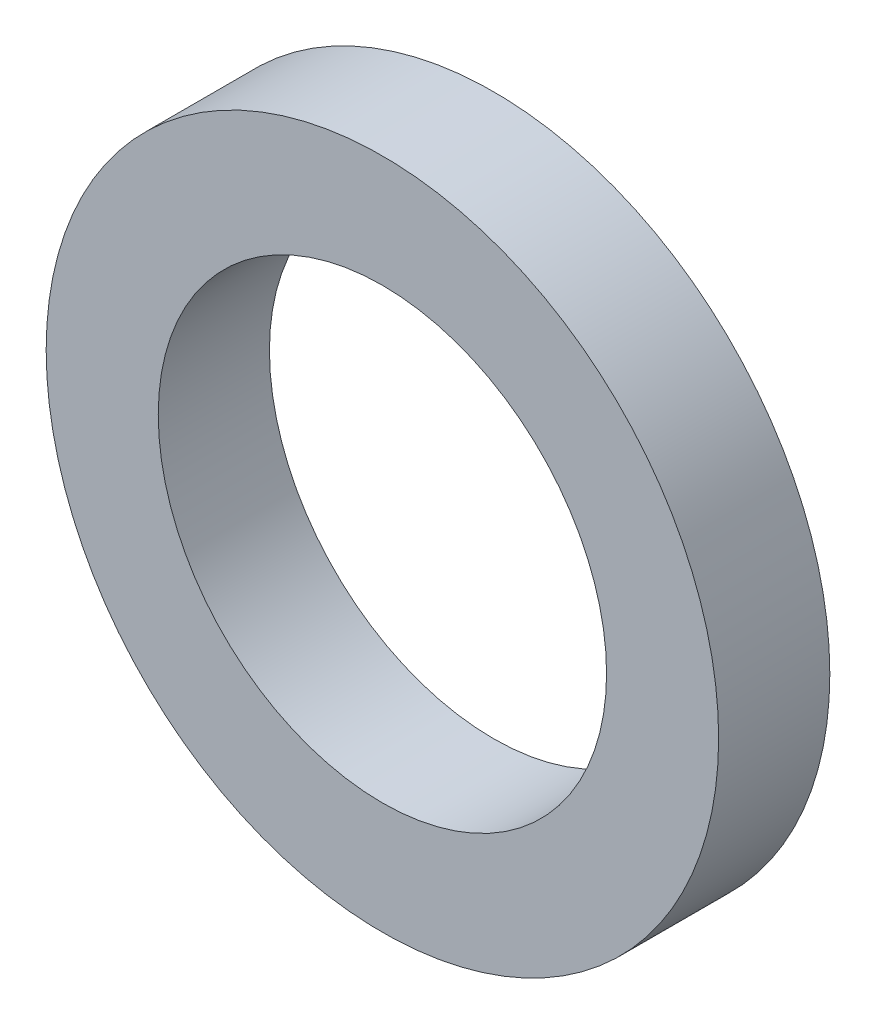
ISO-10303-21;
HEADER;
FILE_DESCRIPTION(('STEP AP214'),'2;1');
FILE_NAME('part.step','',(''),(''),'','','');
FILE_SCHEMA(('AUTOMOTIVE_DESIGN { 1 0 10303 214 1 1 1 1 }'));
ENDSEC;
DATA;
#1=APPLICATION_CONTEXT('core data for automotive mechanical design processes');
#2=APPLICATION_PROTOCOL_DEFINITION('international standard','automotive_design',2000,#1);
#3=PRODUCT_CONTEXT('',#1,'mechanical');
#4=PRODUCT('Part','Part','',(#3));
#5=PRODUCT_RELATED_PRODUCT_CATEGORY('part','',(#4));
#6=PRODUCT_DEFINITION_FORMATION('','',#4);
#7=PRODUCT_DEFINITION_CONTEXT('part definition',#1,'design');
#8=PRODUCT_DEFINITION('design','',#6,#7);
#9=PRODUCT_DEFINITION_SHAPE('','',#8);
#10=(LENGTH_UNIT() NAMED_UNIT(*) SI_UNIT(.MILLI.,.METRE.));
#11=(NAMED_UNIT(*) PLANE_ANGLE_UNIT() SI_UNIT($,.RADIAN.));
#12=(NAMED_UNIT(*) SI_UNIT($,.STERADIAN.) SOLID_ANGLE_UNIT());
#13=UNCERTAINTY_MEASURE_WITH_UNIT(LENGTH_MEASURE(1.E-05),#10,'distance_accuracy_value','');
#14=(GEOMETRIC_REPRESENTATION_CONTEXT(3) GLOBAL_UNCERTAINTY_ASSIGNED_CONTEXT((#13)) GLOBAL_UNIT_ASSIGNED_CONTEXT((#10,
#11,#12)) REPRESENTATION_CONTEXT('',''));
#15=CARTESIAN_POINT('',(0.,0.,0.));
#16=DIRECTION('',(0.,0.,1.));
#17=DIRECTION('',(1.,0.,0.));
#18=AXIS2_PLACEMENT_3D('',#15,#16,#17);
#19=CARTESIAN_POINT('',(0.,0.,0.));
#20=DIRECTION('',(0.,0.,1.));
#21=DIRECTION('',(1.,0.,0.));
#22=AXIS2_PLACEMENT_3D('',#19,#20,#21);
#23=CYLINDRICAL_SURFACE('',#22,1.5875);
#24=CARTESIAN_POINT('',(0.,0.,0.7874));
#25=DIRECTION('',(0.,0.,1.));
#26=DIRECTION('',(1.,0.,0.));
#27=AXIS2_PLACEMENT_3D('',#24,#25,#26);
#28=CIRCLE('',#27,1.5875);
#29=CARTESIAN_POINT('',(1.5875,0.,0.7874));
#30=VERTEX_POINT('',#29);
#31=EDGE_CURVE('E10',#30,#30,#28,.T.);
#32=ORIENTED_EDGE('',*,*,#31,.T.);
#33=EDGE_LOOP('',(#32));
#34=FACE_BOUND('',#33,.T.);
#35=CARTESIAN_POINT('',(0.,0.,0.));
#36=DIRECTION('',(0.,0.,1.));
#37=DIRECTION('',(1.,0.,0.));
#38=AXIS2_PLACEMENT_3D('',#35,#36,#37);
#39=CIRCLE('',#38,1.5875);
#40=CARTESIAN_POINT('',(1.5875,0.,0.));
#41=VERTEX_POINT('',#40);
#42=EDGE_CURVE('E45',#41,#41,#39,.T.);
#43=ORIENTED_EDGE('',*,*,#42,.F.);
#44=EDGE_LOOP('',(#43));
#45=FACE_BOUND('',#44,.T.);
#46=ADVANCED_FACE('F31',(#34,#45),#23,.F.);
#47=CARTESIAN_POINT('',(1.5875,0.,0.7874));
#48=DIRECTION('',(0.,0.,1.));
#49=DIRECTION('',(1.,0.,0.));
#50=AXIS2_PLACEMENT_3D('',#47,#48,#49);
#51=PLANE('',#50);
#52=CARTESIAN_POINT('',(0.,0.,0.7874));
#53=DIRECTION('',(0.,0.,1.));
#54=DIRECTION('',(1.,0.,0.));
#55=AXIS2_PLACEMENT_3D('',#52,#53,#54);
#56=CIRCLE('',#55,2.38125);
#57=CARTESIAN_POINT('',(2.38125,0.,0.7874));
#58=VERTEX_POINT('',#57);
#59=EDGE_CURVE('E37',#58,#58,#56,.T.);
#60=ORIENTED_EDGE('',*,*,#59,.T.);
#61=EDGE_LOOP('',(#60));
#62=FACE_BOUND('',#61,.T.);
#63=ORIENTED_EDGE('',*,*,#31,.F.);
#64=EDGE_LOOP('',(#63));
#65=FACE_BOUND('',#64,.T.);
#66=ADVANCED_FACE('F55',(#62,#65),#51,.T.);
#67=CARTESIAN_POINT('',(0.,0.,0.));
#68=DIRECTION('',(0.,0.,1.));
#69=DIRECTION('',(1.,0.,0.));
#70=AXIS2_PLACEMENT_3D('',#67,#68,#69);
#71=CYLINDRICAL_SURFACE('',#70,2.38125);
#72=CARTESIAN_POINT('',(0.,0.,0.));
#73=DIRECTION('',(0.,0.,1.));
#74=DIRECTION('',(1.,0.,0.));
#75=AXIS2_PLACEMENT_3D('',#72,#73,#74);
#76=CIRCLE('',#75,2.38125);
#77=CARTESIAN_POINT('',(2.38125,0.,0.));
#78=VERTEX_POINT('',#77);
#79=EDGE_CURVE('E41',#78,#78,#76,.T.);
#80=ORIENTED_EDGE('',*,*,#79,.T.);
#81=EDGE_LOOP('',(#80));
#82=FACE_BOUND('',#81,.T.);
#83=ORIENTED_EDGE('',*,*,#59,.F.);
#84=EDGE_LOOP('',(#83));
#85=FACE_BOUND('',#84,.T.);
#86=ADVANCED_FACE('F59',(#82,#85),#71,.T.);
#87=CARTESIAN_POINT('',(2.38125,0.,0.));
#88=DIRECTION('',(0.,0.,-1.));
#89=DIRECTION('',(-1.,0.,0.));
#90=AXIS2_PLACEMENT_3D('',#87,#88,#89);
#91=PLANE('',#90);
#92=ORIENTED_EDGE('',*,*,#42,.T.);
#93=EDGE_LOOP('',(#92));
#94=FACE_BOUND('',#93,.T.);
#95=ORIENTED_EDGE('',*,*,#79,.F.);
#96=EDGE_LOOP('',(#95));
#97=FACE_BOUND('',#96,.T.);
#98=ADVANCED_FACE('F51',(#94,#97),#91,.T.);
#99=CLOSED_SHELL('',(#46,#66,#86,#98));
#100=MANIFOLD_SOLID_BREP('B2',#99);
#101=ADVANCED_BREP_SHAPE_REPRESENTATION('',(#18,#100),#14);
#102=SHAPE_DEFINITION_REPRESENTATION(#9,#101);
ENDSEC;
END-ISO-10303-21;
